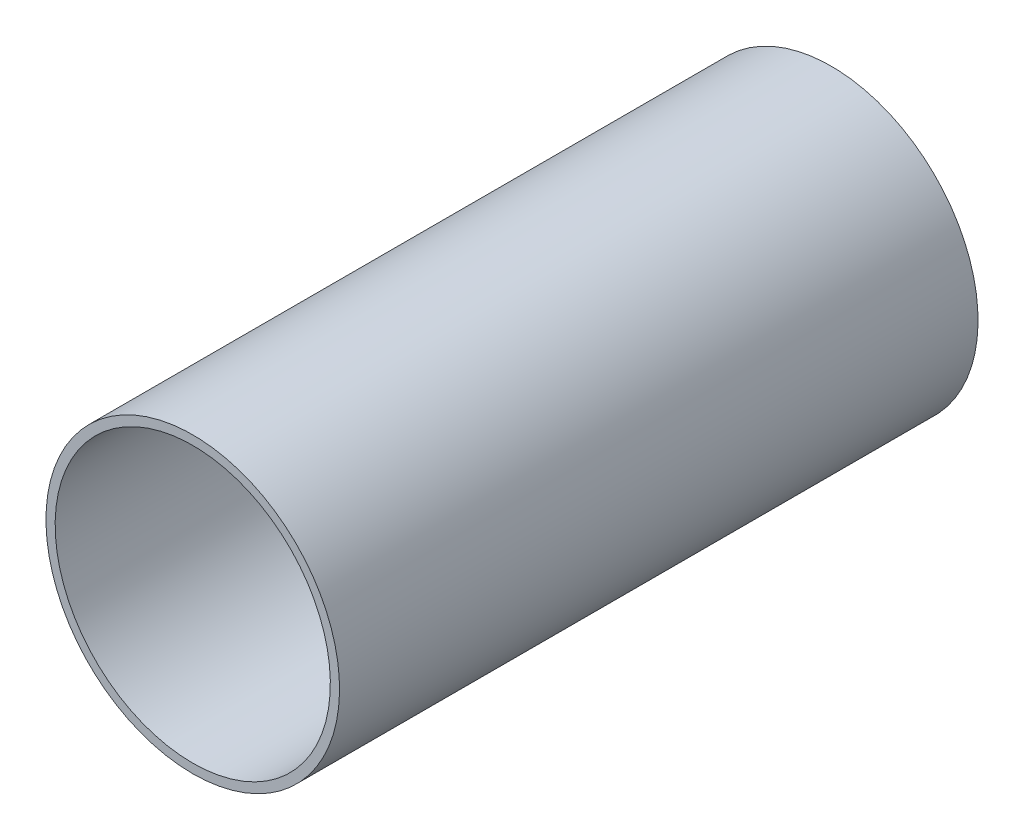
ISO-10303-21;
HEADER;
FILE_DESCRIPTION(('STEP AP214'),'2;1');
FILE_NAME('part.step','',(''),(''),'','','');
FILE_SCHEMA(('AUTOMOTIVE_DESIGN { 1 0 10303 214 1 1 1 1 }'));
ENDSEC;
DATA;
#1=APPLICATION_CONTEXT('core data for automotive mechanical design processes');
#2=APPLICATION_PROTOCOL_DEFINITION('international standard','automotive_design',2000,#1);
#3=PRODUCT_CONTEXT('',#1,'mechanical');
#4=PRODUCT('Part','Part','',(#3));
#5=PRODUCT_RELATED_PRODUCT_CATEGORY('part','',(#4));
#6=PRODUCT_DEFINITION_FORMATION('','',#4);
#7=PRODUCT_DEFINITION_CONTEXT('part definition',#1,'design');
#8=PRODUCT_DEFINITION('design','',#6,#7);
#9=PRODUCT_DEFINITION_SHAPE('','',#8);
#10=(LENGTH_UNIT() NAMED_UNIT(*) SI_UNIT(.MILLI.,.METRE.));
#11=(NAMED_UNIT(*) PLANE_ANGLE_UNIT() SI_UNIT($,.RADIAN.));
#12=(NAMED_UNIT(*) SI_UNIT($,.STERADIAN.) SOLID_ANGLE_UNIT());
#13=UNCERTAINTY_MEASURE_WITH_UNIT(LENGTH_MEASURE(1.E-05),#10,'distance_accuracy_value','');
#14=(GEOMETRIC_REPRESENTATION_CONTEXT(3) GLOBAL_UNCERTAINTY_ASSIGNED_CONTEXT((#13)) GLOBAL_UNIT_ASSIGNED_CONTEXT((#10,
#11,#12)) REPRESENTATION_CONTEXT('',''));
#15=CARTESIAN_POINT('',(0.,0.,0.));
#16=DIRECTION('',(0.,0.,1.));
#17=DIRECTION('',(1.,0.,0.));
#18=AXIS2_PLACEMENT_3D('',#15,#16,#17);
#19=CARTESIAN_POINT('',(165.608,-76.2,-0.045));
#20=DIRECTION('',(0.,0.,-1.));
#21=DIRECTION('',(0.,-1.,0.));
#22=AXIS2_PLACEMENT_3D('',#19,#20,#21);
#23=CYLINDRICAL_SURFACE('',#22,0.375);
#24=CARTESIAN_POINT('',(165.608,-76.2,-0.035));
#25=DIRECTION('',(0.,0.,-1.));
#26=DIRECTION('',(0.,-1.,0.));
#27=AXIS2_PLACEMENT_3D('',#24,#25,#26);
#28=CIRCLE('',#27,0.375);
#29=CARTESIAN_POINT('',(165.608,-76.575,-0.035));
#30=VERTEX_POINT('',#29);
#31=EDGE_CURVE('E53',#30,#30,#28,.T.);
#32=ORIENTED_EDGE('',*,*,#31,.T.);
#33=DIRECTION('',(0.,0.,1.));
#34=VECTOR('',#33,1.);
#35=CARTESIAN_POINT('',(165.608,-76.575,-0.045));
#36=LINE('',#35,#34);
#37=CARTESIAN_POINT('',(165.608,-76.575,1.705));
#38=VERTEX_POINT('',#37);
#39=EDGE_CURVE('E11',#30,#38,#36,.T.);
#40=ORIENTED_EDGE('',*,*,#39,.T.);
#41=CARTESIAN_POINT('',(165.608,-76.2,1.705));
#42=DIRECTION('',(0.,0.,-1.));
#43=DIRECTION('',(0.,-1.,0.));
#44=AXIS2_PLACEMENT_3D('',#41,#42,#43);
#45=CIRCLE('',#44,0.375);
#46=EDGE_CURVE('E26',#38,#38,#45,.T.);
#47=ORIENTED_EDGE('',*,*,#46,.F.);
#48=ORIENTED_EDGE('',*,*,#39,.F.);
#49=EDGE_LOOP('',(#32,#40,#47,#48));
#50=FACE_BOUND('',#49,.T.);
#51=ADVANCED_FACE('F17',(#50),#23,.F.);
#52=CARTESIAN_POINT('',(165.608,-76.6,1.705));
#53=DIRECTION('',(0.,0.,1.));
#54=DIRECTION('',(1.,0.,0.));
#55=AXIS2_PLACEMENT_3D('',#52,#53,#54);
#56=PLANE('',#55);
#57=ORIENTED_EDGE('',*,*,#46,.T.);
#58=EDGE_LOOP('',(#57));
#59=FACE_BOUND('',#58,.T.);
#60=CARTESIAN_POINT('',(165.608,-76.2,1.705));
#61=DIRECTION('',(0.,0.,1.));
#62=DIRECTION('',(0.,-1.,0.));
#63=AXIS2_PLACEMENT_3D('',#60,#61,#62);
#64=CIRCLE('',#63,0.4);
#65=CARTESIAN_POINT('',(165.608,-76.6,1.705));
#66=VERTEX_POINT('',#65);
#67=EDGE_CURVE('E48',#66,#66,#64,.T.);
#68=ORIENTED_EDGE('',*,*,#67,.T.);
#69=EDGE_LOOP('',(#68));
#70=FACE_BOUND('',#69,.T.);
#71=ADVANCED_FACE('F49',(#59,#70),#56,.T.);
#72=CARTESIAN_POINT('',(165.608,-76.6,-0.035));
#73=DIRECTION('',(0.,0.,1.));
#74=DIRECTION('',(1.,0.,0.));
#75=AXIS2_PLACEMENT_3D('',#72,#73,#74);
#76=PLANE('',#75);
#77=ORIENTED_EDGE('',*,*,#31,.F.);
#78=EDGE_LOOP('',(#77));
#79=FACE_BOUND('',#78,.T.);
#80=CARTESIAN_POINT('',(165.608,-76.2,-0.035));
#81=DIRECTION('',(0.,0.,1.));
#82=DIRECTION('',(0.,-1.,0.));
#83=AXIS2_PLACEMENT_3D('',#80,#81,#82);
#84=CIRCLE('',#83,0.4);
#85=CARTESIAN_POINT('',(165.608,-76.6,-0.035));
#86=VERTEX_POINT('',#85);
#87=EDGE_CURVE('E62',#86,#86,#84,.T.);
#88=ORIENTED_EDGE('',*,*,#87,.F.);
#89=EDGE_LOOP('',(#88));
#90=FACE_BOUND('',#89,.T.);
#91=ADVANCED_FACE('F70',(#79,#90),#76,.F.);
#92=CARTESIAN_POINT('',(165.608,-76.2,-0.035));
#93=DIRECTION('',(0.,0.,-1.));
#94=DIRECTION('',(0.,-1.,0.));
#95=AXIS2_PLACEMENT_3D('',#92,#93,#94);
#96=CYLINDRICAL_SURFACE('',#95,0.4);
#97=ORIENTED_EDGE('',*,*,#87,.T.);
#98=DIRECTION('',(0.,0.,1.));
#99=VECTOR('',#98,1.);
#100=CARTESIAN_POINT('',(165.608,-76.6,-0.035));
#101=LINE('',#100,#99);
#102=EDGE_CURVE('E54',#86,#66,#101,.T.);
#103=ORIENTED_EDGE('',*,*,#102,.T.);
#104=ORIENTED_EDGE('',*,*,#67,.F.);
#105=ORIENTED_EDGE('',*,*,#102,.F.);
#106=EDGE_LOOP('',(#97,#103,#104,#105));
#107=FACE_BOUND('',#106,.T.);
#108=ADVANCED_FACE('F73',(#107),#96,.T.);
#109=CLOSED_SHELL('',(#51,#71,#91,#108));
#110=MANIFOLD_SOLID_BREP('B1',#109);
#111=ADVANCED_BREP_SHAPE_REPRESENTATION('',(#18,#110),#14);
#112=SHAPE_DEFINITION_REPRESENTATION(#9,#111);
ENDSEC;
END-ISO-10303-21;
